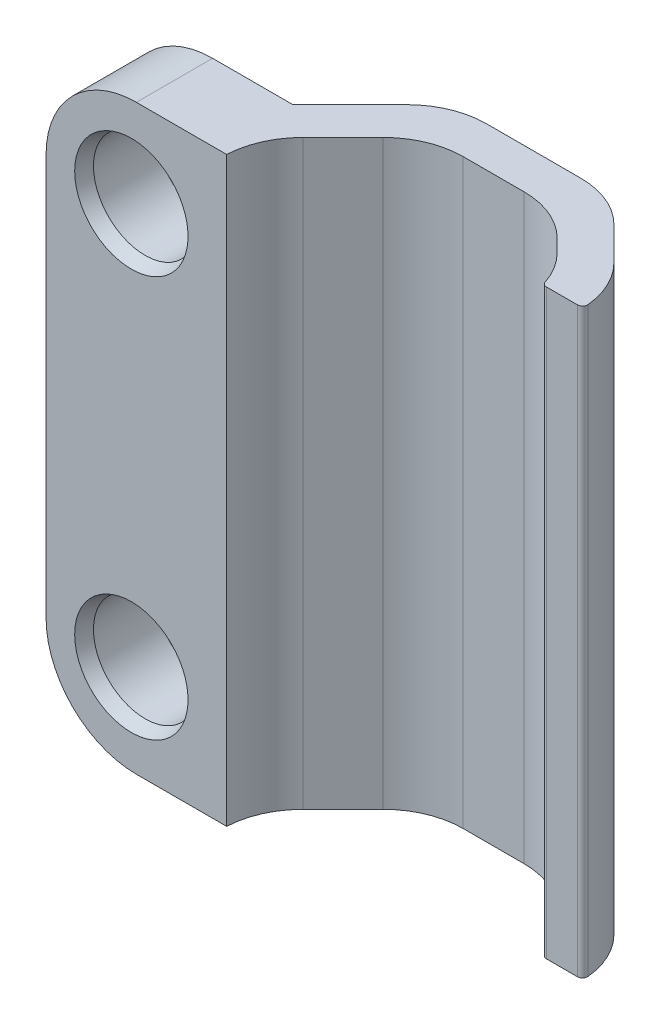
ISO-10303-21;
HEADER;
FILE_DESCRIPTION(('STEP AP214'),'2;1');
FILE_NAME('part.step','',(''),(''),'','','');
FILE_SCHEMA(('AUTOMOTIVE_DESIGN { 1 0 10303 214 1 1 1 1 }'));
ENDSEC;
DATA;
#1=APPLICATION_CONTEXT('core data for automotive mechanical design processes');
#2=APPLICATION_PROTOCOL_DEFINITION('international standard','automotive_design',2000,#1);
#3=PRODUCT_CONTEXT('',#1,'mechanical');
#4=PRODUCT('Part','Part','',(#3));
#5=PRODUCT_RELATED_PRODUCT_CATEGORY('part','',(#4));
#6=PRODUCT_DEFINITION_FORMATION('','',#4);
#7=PRODUCT_DEFINITION_CONTEXT('part definition',#1,'design');
#8=PRODUCT_DEFINITION('design','',#6,#7);
#9=PRODUCT_DEFINITION_SHAPE('','',#8);
#10=(LENGTH_UNIT() NAMED_UNIT(*) SI_UNIT(.MILLI.,.METRE.));
#11=(NAMED_UNIT(*) PLANE_ANGLE_UNIT() SI_UNIT($,.RADIAN.));
#12=(NAMED_UNIT(*) SI_UNIT($,.STERADIAN.) SOLID_ANGLE_UNIT());
#13=UNCERTAINTY_MEASURE_WITH_UNIT(LENGTH_MEASURE(1.E-05),#10,'distance_accuracy_value','');
#14=(GEOMETRIC_REPRESENTATION_CONTEXT(3) GLOBAL_UNCERTAINTY_ASSIGNED_CONTEXT((#13)) GLOBAL_UNIT_ASSIGNED_CONTEXT((#10,
#11,#12)) REPRESENTATION_CONTEXT('',''));
#15=CARTESIAN_POINT('',(0.,0.,0.));
#16=DIRECTION('',(0.,0.,1.));
#17=DIRECTION('',(1.,0.,0.));
#18=AXIS2_PLACEMENT_3D('',#15,#16,#17);
#19=CARTESIAN_POINT('',(0.,29.,0.));
#20=DIRECTION('',(0.,0.,-1.));
#21=DIRECTION('',(-1.,0.,0.));
#22=AXIS2_PLACEMENT_3D('',#19,#20,#21);
#23=PLANE('',#22);
#24=CARTESIAN_POINT('',(4.25,24.5,0.));
#25=DIRECTION('',(0.,0.,-1.));
#26=DIRECTION('',(-1.,0.,0.));
#27=AXIS2_PLACEMENT_3D('',#24,#25,#26);
#28=CIRCLE('',#27,2.82500000000005);
#29=CARTESIAN_POINT('',(1.42499999999995,24.5,0.));
#30=VERTEX_POINT('',#29);
#31=EDGE_CURVE('E258',#30,#30,#28,.T.);
#32=ORIENTED_EDGE('',*,*,#31,.T.);
#33=EDGE_LOOP('',(#32));
#34=FACE_BOUND('',#33,.T.);
#35=CARTESIAN_POINT('',(4.25,4.5,0.));
#36=DIRECTION('',(0.,0.,-1.));
#37=DIRECTION('',(-1.,0.,0.));
#38=AXIS2_PLACEMENT_3D('',#35,#36,#37);
#39=CIRCLE('',#38,2.82500000000005);
#40=CARTESIAN_POINT('',(1.42499999999995,4.5,0.));
#41=VERTEX_POINT('',#40);
#42=EDGE_CURVE('E255',#41,#41,#39,.T.);
#43=ORIENTED_EDGE('',*,*,#42,.T.);
#44=EDGE_LOOP('',(#43));
#45=FACE_BOUND('',#44,.T.);
#46=DIRECTION('',(0.,-1.,0.));
#47=VECTOR('',#46,1.);
#48=CARTESIAN_POINT('',(0.,29.,0.));
#49=LINE('',#48,#47);
#50=CARTESIAN_POINT('',(0.,24.5,0.));
#51=VERTEX_POINT('',#50);
#52=CARTESIAN_POINT('',(0.,4.50000000000001,0.));
#53=VERTEX_POINT('',#52);
#54=EDGE_CURVE('E396',#51,#53,#49,.T.);
#55=ORIENTED_EDGE('',*,*,#54,.T.);
#56=CARTESIAN_POINT('',(4.5,4.5,0.));
#57=DIRECTION('',(0.,0.,-1.));
#58=DIRECTION('',(-1.,0.,0.));
#59=AXIS2_PLACEMENT_3D('',#56,#57,#58);
#60=CIRCLE('',#59,4.5);
#61=CARTESIAN_POINT('',(4.5,0.,0.));
#62=VERTEX_POINT('',#61);
#63=EDGE_CURVE('E372',#53,#62,#60,.F.);
#64=ORIENTED_EDGE('',*,*,#63,.T.);
#65=DIRECTION('',(1.,0.,0.));
#66=VECTOR('',#65,1.);
#67=CARTESIAN_POINT('',(0.,0.,0.));
#68=LINE('',#67,#66);
#69=CARTESIAN_POINT('',(9.,0.,0.));
#70=VERTEX_POINT('',#69);
#71=EDGE_CURVE('E226',#62,#70,#68,.T.);
#72=ORIENTED_EDGE('',*,*,#71,.T.);
#73=DIRECTION('',(0.,-1.,0.));
#74=VECTOR('',#73,1.);
#75=CARTESIAN_POINT('',(9.,29.,0.));
#76=LINE('',#75,#74);
#77=CARTESIAN_POINT('',(9.,29.,0.));
#78=VERTEX_POINT('',#77);
#79=EDGE_CURVE('E223',#78,#70,#76,.T.);
#80=ORIENTED_EDGE('',*,*,#79,.F.);
#81=DIRECTION('',(1.,0.,0.));
#82=VECTOR('',#81,1.);
#83=CARTESIAN_POINT('',(0.,29.,0.));
#84=LINE('',#83,#82);
#85=CARTESIAN_POINT('',(4.5,29.,0.));
#86=VERTEX_POINT('',#85);
#87=EDGE_CURVE('E206',#86,#78,#84,.T.);
#88=ORIENTED_EDGE('',*,*,#87,.F.);
#89=CARTESIAN_POINT('',(4.5,24.5,0.));
#90=DIRECTION('',(0.,0.,-1.));
#91=DIRECTION('',(-1.,0.,0.));
#92=AXIS2_PLACEMENT_3D('',#89,#90,#91);
#93=CIRCLE('',#92,4.5);
#94=EDGE_CURVE('E374',#86,#51,#93,.F.);
#95=ORIENTED_EDGE('',*,*,#94,.T.);
#96=EDGE_LOOP('',(#55,#64,#72,#80,#88,#95));
#97=FACE_BOUND('',#96,.T.);
#98=ADVANCED_FACE('F39',(#34,#45,#97),#23,.F.);
#99=CARTESIAN_POINT('',(13.3284271247462,29.,-5.8));
#100=DIRECTION('',(-0.707106781186549,0.,-0.707106781186546));
#101=DIRECTION('',(-0.707106781186546,0.,0.707106781186549));
#102=AXIS2_PLACEMENT_3D('',#99,#100,#101);
#103=PLANE('',#102);
#104=DIRECTION('',(0.707106781186546,0.,-0.707106781186549));
#105=VECTOR('',#104,1.);
#106=CARTESIAN_POINT('',(13.3284271247462,29.,-5.8));
#107=LINE('',#106,#105);
#108=CARTESIAN_POINT('',(10.167067985237,29.,-2.63864086049085));
#109=VERTEX_POINT('',#108);
#110=CARTESIAN_POINT('',(12.1568542494924,29.,-4.62842712474618));
#111=VERTEX_POINT('',#110);
#112=EDGE_CURVE('E218',#109,#111,#107,.T.);
#113=ORIENTED_EDGE('',*,*,#112,.F.);
#114=DIRECTION('',(0.,-1.,0.));
#115=VECTOR('',#114,1.);
#116=CARTESIAN_POINT('',(10.167067985237,29.,-2.63864086049085));
#117=LINE('',#116,#115);
#118=CARTESIAN_POINT('',(10.167067985237,0.,-2.63864086049085));
#119=VERTEX_POINT('',#118);
#120=EDGE_CURVE('E235',#109,#119,#117,.T.);
#121=ORIENTED_EDGE('',*,*,#120,.T.);
#122=DIRECTION('',(0.707106781186546,0.,-0.707106781186549));
#123=VECTOR('',#122,1.);
#124=CARTESIAN_POINT('',(13.3284271247462,0.,-5.8));
#125=LINE('',#124,#123);
#126=CARTESIAN_POINT('',(12.1568542494924,0.,-4.62842712474618));
#127=VERTEX_POINT('',#126);
#128=EDGE_CURVE('E416',#119,#127,#125,.T.);
#129=ORIENTED_EDGE('',*,*,#128,.T.);
#130=DIRECTION('',(0.,-1.,0.));
#131=VECTOR('',#130,1.);
#132=CARTESIAN_POINT('',(12.1568542494924,29.,-4.62842712474618));
#133=LINE('',#132,#131);
#134=EDGE_CURVE('E331',#127,#111,#133,.F.);
#135=ORIENTED_EDGE('',*,*,#134,.T.);
#136=EDGE_LOOP('',(#113,#121,#129,#135));
#137=FACE_BOUND('',#136,.T.);
#138=ADVANCED_FACE('F465',(#137),#103,.F.);
#139=CARTESIAN_POINT('',(19.6715728752538,29.,-5.8));
#140=DIRECTION('',(0.,0.,-1.));
#141=DIRECTION('',(-1.,0.,0.));
#142=AXIS2_PLACEMENT_3D('',#139,#140,#141);
#143=PLANE('',#142);
#144=DIRECTION('',(1.,0.,0.));
#145=VECTOR('',#144,1.);
#146=CARTESIAN_POINT('',(19.6715728752538,0.,-5.8));
#147=LINE('',#146,#145);
#148=CARTESIAN_POINT('',(14.9852813742386,0.,-5.8));
#149=VERTEX_POINT('',#148);
#150=CARTESIAN_POINT('',(18.0147186257614,0.,-5.8));
#151=VERTEX_POINT('',#150);
#152=EDGE_CURVE('E413',#149,#151,#147,.T.);
#153=ORIENTED_EDGE('',*,*,#152,.T.);
#154=DIRECTION('',(0.,-1.,0.));
#155=VECTOR('',#154,1.);
#156=CARTESIAN_POINT('',(18.0147186257614,29.,-5.8));
#157=LINE('',#156,#155);
#158=CARTESIAN_POINT('',(18.0147186257614,29.,-5.8));
#159=VERTEX_POINT('',#158);
#160=EDGE_CURVE('E323',#151,#159,#157,.F.);
#161=ORIENTED_EDGE('',*,*,#160,.T.);
#162=DIRECTION('',(1.,0.,0.));
#163=VECTOR('',#162,1.);
#164=CARTESIAN_POINT('',(19.6715728752538,29.,-5.8));
#165=LINE('',#164,#163);
#166=CARTESIAN_POINT('',(14.9852813742386,29.,-5.8));
#167=VERTEX_POINT('',#166);
#168=EDGE_CURVE('E433',#167,#159,#165,.T.);
#169=ORIENTED_EDGE('',*,*,#168,.F.);
#170=DIRECTION('',(0.,-1.,0.));
#171=VECTOR('',#170,1.);
#172=CARTESIAN_POINT('',(14.9852813742386,0.,-5.8));
#173=LINE('',#172,#171);
#174=EDGE_CURVE('E326',#167,#149,#173,.T.);
#175=ORIENTED_EDGE('',*,*,#174,.T.);
#176=EDGE_LOOP('',(#153,#161,#169,#175));
#177=FACE_BOUND('',#176,.T.);
#178=ADVANCED_FACE('F447',(#177),#143,.F.);
#179=CARTESIAN_POINT('',(22.5,29.,-2.97157287525381));
#180=DIRECTION('',(0.707106781186549,0.,-0.707106781186546));
#181=DIRECTION('',(-0.707106781186546,0.,-0.707106781186549));
#182=AXIS2_PLACEMENT_3D('',#179,#180,#181);
#183=PLANE('',#182);
#184=DIRECTION('',(0.707106781186546,0.,0.707106781186549));
#185=VECTOR('',#184,1.);
#186=CARTESIAN_POINT('',(22.5,0.,-2.97157287525381));
#187=LINE('',#186,#185);
#188=CARTESIAN_POINT('',(20.8431457505076,0.,-4.62842712474618));
#189=VERTEX_POINT('',#188);
#190=CARTESIAN_POINT('',(21.4784878304969,0.,-3.99308504475687));
#191=VERTEX_POINT('',#190);
#192=EDGE_CURVE('E411',#189,#191,#187,.T.);
#193=ORIENTED_EDGE('',*,*,#192,.T.);
#194=DIRECTION('',(0.,1.,0.));
#195=VECTOR('',#194,1.);
#196=CARTESIAN_POINT('',(21.4784878304969,29.,-3.99308504475687));
#197=LINE('',#196,#195);
#198=CARTESIAN_POINT('',(21.4784878304969,29.,-3.99308504475687));
#199=VERTEX_POINT('',#198);
#200=EDGE_CURVE('E309',#191,#199,#197,.T.);
#201=ORIENTED_EDGE('',*,*,#200,.T.);
#202=DIRECTION('',(0.707106781186546,0.,0.707106781186549));
#203=VECTOR('',#202,1.);
#204=CARTESIAN_POINT('',(22.5,29.,-2.97157287525381));
#205=LINE('',#204,#203);
#206=CARTESIAN_POINT('',(20.8431457505076,29.,-4.62842712474618));
#207=VERTEX_POINT('',#206);
#208=EDGE_CURVE('E298',#207,#199,#205,.T.);
#209=ORIENTED_EDGE('',*,*,#208,.F.);
#210=DIRECTION('',(0.,-1.,0.));
#211=VECTOR('',#210,1.);
#212=CARTESIAN_POINT('',(20.8431457505076,0.,-4.62842712474618));
#213=LINE('',#212,#211);
#214=EDGE_CURVE('E336',#207,#189,#213,.T.);
#215=ORIENTED_EDGE('',*,*,#214,.T.);
#216=EDGE_LOOP('',(#193,#201,#209,#215));
#217=FACE_BOUND('',#216,.T.);
#218=ADVANCED_FACE('F456',(#217),#183,.F.);
#219=CARTESIAN_POINT('',(22.5,29.,-2.25));
#220=DIRECTION('',(0.,0.,-1.));
#221=DIRECTION('',(-1.,0.,0.));
#222=AXIS2_PLACEMENT_3D('',#219,#220,#221);
#223=PLANE('',#222);
#224=DIRECTION('',(1.,0.,0.));
#225=VECTOR('',#224,1.);
#226=CARTESIAN_POINT('',(22.5,29.,-2.25));
#227=LINE('',#226,#225);
#228=CARTESIAN_POINT('',(22.6848297858109,29.,-2.25));
#229=VERTEX_POINT('',#228);
#230=CARTESIAN_POINT('',(24.2343084879791,29.,-2.25));
#231=VERTEX_POINT('',#230);
#232=EDGE_CURVE('E288',#229,#231,#227,.T.);
#233=ORIENTED_EDGE('',*,*,#232,.F.);
#234=DIRECTION('',(0.,1.,0.));
#235=VECTOR('',#234,1.);
#236=CARTESIAN_POINT('',(22.6848297858109,29.,-2.25));
#237=LINE('',#236,#235);
#238=CARTESIAN_POINT('',(22.6848297858109,0.,-2.25));
#239=VERTEX_POINT('',#238);
#240=EDGE_CURVE('E272',#229,#239,#237,.F.);
#241=ORIENTED_EDGE('',*,*,#240,.T.);
#242=DIRECTION('',(1.,0.,0.));
#243=VECTOR('',#242,1.);
#244=CARTESIAN_POINT('',(22.5,0.,-2.25));
#245=LINE('',#244,#243);
#246=CARTESIAN_POINT('',(24.2343084879791,0.,-2.25));
#247=VERTEX_POINT('',#246);
#248=EDGE_CURVE('E306',#239,#247,#245,.T.);
#249=ORIENTED_EDGE('',*,*,#248,.T.);
#250=DIRECTION('',(0.,1.,0.));
#251=VECTOR('',#250,1.);
#252=CARTESIAN_POINT('',(24.2343084879791,29.,-2.25));
#253=LINE('',#252,#251);
#254=EDGE_CURVE('E269',#247,#231,#253,.T.);
#255=ORIENTED_EDGE('',*,*,#254,.T.);
#256=EDGE_LOOP('',(#233,#241,#249,#255));
#257=FACE_BOUND('',#256,.T.);
#258=ADVANCED_FACE('F293',(#257),#223,.F.);
#259=CARTESIAN_POINT('',(20.5,29.,-7.8));
#260=DIRECTION('',(-0.70710678118655,0.,0.707106781186545));
#261=DIRECTION('',(0.707106781186545,0.,0.70710678118655));
#262=AXIS2_PLACEMENT_3D('',#259,#260,#261);
#263=PLANE('',#262);
#264=DIRECTION('',(-0.707106781186545,0.,-0.70710678118655));
#265=VECTOR('',#264,1.);
#266=CARTESIAN_POINT('',(20.5,29.,-7.8));
#267=LINE('',#266,#265);
#268=CARTESIAN_POINT('',(23.3298940791421,29.,-4.97010592085792));
#269=VERTEX_POINT('',#268);
#270=CARTESIAN_POINT('',(21.6715728752538,29.,-6.62842712474618));
#271=VERTEX_POINT('',#270);
#272=EDGE_CURVE('E297',#269,#271,#267,.T.);
#273=ORIENTED_EDGE('',*,*,#272,.F.);
#274=DIRECTION('',(0.,-1.,0.));
#275=VECTOR('',#274,1.);
#276=CARTESIAN_POINT('',(23.3298940791421,29.,-4.97010592085792));
#277=LINE('',#276,#275);
#278=CARTESIAN_POINT('',(23.3298940791421,0.,-4.97010592085792));
#279=VERTEX_POINT('',#278);
#280=EDGE_CURVE('E356',#269,#279,#277,.T.);
#281=ORIENTED_EDGE('',*,*,#280,.T.);
#282=DIRECTION('',(-0.707106781186545,0.,-0.70710678118655));
#283=VECTOR('',#282,1.);
#284=CARTESIAN_POINT('',(20.5,0.,-7.8));
#285=LINE('',#284,#283);
#286=CARTESIAN_POINT('',(21.6715728752538,0.,-6.62842712474618));
#287=VERTEX_POINT('',#286);
#288=EDGE_CURVE('E407',#279,#287,#285,.T.);
#289=ORIENTED_EDGE('',*,*,#288,.T.);
#290=DIRECTION('',(0.,-1.,0.));
#291=VECTOR('',#290,1.);
#292=CARTESIAN_POINT('',(21.6715728752538,29.,-6.62842712474618));
#293=LINE('',#292,#291);
#294=EDGE_CURVE('E360',#287,#271,#293,.F.);
#295=ORIENTED_EDGE('',*,*,#294,.T.);
#296=EDGE_LOOP('',(#273,#281,#289,#295));
#297=FACE_BOUND('',#296,.T.);
#298=ADVANCED_FACE('F463',(#297),#263,.F.);
#299=CARTESIAN_POINT('',(12.5,29.,-7.8));
#300=DIRECTION('',(0.,0.,1.));
#301=DIRECTION('',(1.,0.,0.));
#302=AXIS2_PLACEMENT_3D('',#299,#300,#301);
#303=PLANE('',#302);
#304=DIRECTION('',(-1.,0.,0.));
#305=VECTOR('',#304,1.);
#306=CARTESIAN_POINT('',(12.5,29.,-7.8));
#307=LINE('',#306,#305);
#308=CARTESIAN_POINT('',(18.8431457505076,29.,-7.8));
#309=VERTEX_POINT('',#308);
#310=CARTESIAN_POINT('',(14.1568542494924,29.,-7.8));
#311=VERTEX_POINT('',#310);
#312=EDGE_CURVE('E425',#309,#311,#307,.T.);
#313=ORIENTED_EDGE('',*,*,#312,.F.);
#314=DIRECTION('',(0.,-1.,0.));
#315=VECTOR('',#314,1.);
#316=CARTESIAN_POINT('',(18.8431457505076,29.,-7.8));
#317=LINE('',#316,#315);
#318=CARTESIAN_POINT('',(18.8431457505076,0.,-7.8));
#319=VERTEX_POINT('',#318);
#320=EDGE_CURVE('E314',#309,#319,#317,.T.);
#321=ORIENTED_EDGE('',*,*,#320,.T.);
#322=DIRECTION('',(-1.,0.,0.));
#323=VECTOR('',#322,1.);
#324=CARTESIAN_POINT('',(12.5,0.,-7.8));
#325=LINE('',#324,#323);
#326=CARTESIAN_POINT('',(14.1568542494924,0.,-7.8));
#327=VERTEX_POINT('',#326);
#328=EDGE_CURVE('E404',#319,#327,#325,.T.);
#329=ORIENTED_EDGE('',*,*,#328,.T.);
#330=DIRECTION('',(0.,-1.,0.));
#331=VECTOR('',#330,1.);
#332=CARTESIAN_POINT('',(14.1568542494924,29.,-7.8));
#333=LINE('',#332,#331);
#334=EDGE_CURVE('E320',#327,#311,#333,.F.);
#335=ORIENTED_EDGE('',*,*,#334,.T.);
#336=EDGE_LOOP('',(#313,#321,#329,#335));
#337=FACE_BOUND('',#336,.T.);
#338=ADVANCED_FACE('F531',(#337),#303,.F.);
#339=CARTESIAN_POINT('',(8.5,29.,-3.8));
#340=DIRECTION('',(0.707106781186549,0.,0.707106781186546));
#341=DIRECTION('',(0.707106781186546,0.,-0.707106781186549));
#342=AXIS2_PLACEMENT_3D('',#339,#340,#341);
#343=PLANE('',#342);
#344=DIRECTION('',(-0.707106781186546,0.,0.707106781186549));
#345=VECTOR('',#344,1.);
#346=CARTESIAN_POINT('',(8.5,29.,-3.8));
#347=LINE('',#346,#345);
#348=CARTESIAN_POINT('',(11.3284271247462,29.,-6.62842712474618));
#349=VERTEX_POINT('',#348);
#350=CARTESIAN_POINT('',(8.5,29.,-3.8));
#351=VERTEX_POINT('',#350);
#352=EDGE_CURVE('E422',#349,#351,#347,.T.);
#353=ORIENTED_EDGE('',*,*,#352,.F.);
#354=DIRECTION('',(0.,-1.,0.));
#355=VECTOR('',#354,1.);
#356=CARTESIAN_POINT('',(11.3284271247462,29.,-6.62842712474619));
#357=LINE('',#356,#355);
#358=CARTESIAN_POINT('',(11.3284271247462,0.,-6.62842712474618));
#359=VERTEX_POINT('',#358);
#360=EDGE_CURVE('E310',#349,#359,#357,.T.);
#361=ORIENTED_EDGE('',*,*,#360,.T.);
#362=DIRECTION('',(-0.707106781186546,0.,0.707106781186549));
#363=VECTOR('',#362,1.);
#364=CARTESIAN_POINT('',(8.5,0.,-3.8));
#365=LINE('',#364,#363);
#366=CARTESIAN_POINT('',(8.5,0.,-3.8));
#367=VERTEX_POINT('',#366);
#368=EDGE_CURVE('E402',#359,#367,#365,.T.);
#369=ORIENTED_EDGE('',*,*,#368,.T.);
#370=DIRECTION('',(0.,-1.,0.));
#371=VECTOR('',#370,1.);
#372=CARTESIAN_POINT('',(8.5,29.,-3.8));
#373=LINE('',#372,#371);
#374=EDGE_CURVE('E230',#351,#367,#373,.T.);
#375=ORIENTED_EDGE('',*,*,#374,.F.);
#376=EDGE_LOOP('',(#353,#361,#369,#375));
#377=FACE_BOUND('',#376,.T.);
#378=ADVANCED_FACE('F537',(#377),#343,.F.);
#379=CARTESIAN_POINT('',(0.,29.,-3.8));
#380=DIRECTION('',(0.,0.,1.));
#381=DIRECTION('',(1.,0.,0.));
#382=AXIS2_PLACEMENT_3D('',#379,#380,#381);
#383=PLANE('',#382);
#384=CARTESIAN_POINT('',(4.25,4.5,-3.8));
#385=DIRECTION('',(0.,0.,1.));
#386=DIRECTION('',(1.,0.,0.));
#387=AXIS2_PLACEMENT_3D('',#384,#385,#386);
#388=CIRCLE('',#387,2.575);
#389=CARTESIAN_POINT('',(1.675,4.5,-3.8));
#390=VERTEX_POINT('',#389);
#391=EDGE_CURVE('E382',#390,#390,#388,.T.);
#392=ORIENTED_EDGE('',*,*,#391,.T.);
#393=EDGE_LOOP('',(#392));
#394=FACE_BOUND('',#393,.T.);
#395=CARTESIAN_POINT('',(4.25,24.5,-3.8));
#396=DIRECTION('',(0.,0.,1.));
#397=DIRECTION('',(1.,0.,0.));
#398=AXIS2_PLACEMENT_3D('',#395,#396,#397);
#399=CIRCLE('',#398,2.575);
#400=CARTESIAN_POINT('',(1.675,24.5,-3.8));
#401=VERTEX_POINT('',#400);
#402=EDGE_CURVE('E385',#401,#401,#399,.T.);
#403=ORIENTED_EDGE('',*,*,#402,.T.);
#404=EDGE_LOOP('',(#403));
#405=FACE_BOUND('',#404,.T.);
#406=DIRECTION('',(-1.,0.,0.));
#407=VECTOR('',#406,1.);
#408=CARTESIAN_POINT('',(0.,0.,-3.8));
#409=LINE('',#408,#407);
#410=CARTESIAN_POINT('',(4.5,0.,-3.8));
#411=VERTEX_POINT('',#410);
#412=EDGE_CURVE('E219',#367,#411,#409,.T.);
#413=ORIENTED_EDGE('',*,*,#412,.T.);
#414=CARTESIAN_POINT('',(4.5,4.5,-3.8));
#415=DIRECTION('',(0.,0.,1.));
#416=DIRECTION('',(1.,0.,0.));
#417=AXIS2_PLACEMENT_3D('',#414,#415,#416);
#418=CIRCLE('',#417,4.5);
#419=CARTESIAN_POINT('',(0.,4.50000000000001,-3.8));
#420=VERTEX_POINT('',#419);
#421=EDGE_CURVE('E365',#411,#420,#418,.F.);
#422=ORIENTED_EDGE('',*,*,#421,.T.);
#423=DIRECTION('',(0.,-1.,0.));
#424=VECTOR('',#423,1.);
#425=CARTESIAN_POINT('',(0.,29.,-3.8));
#426=LINE('',#425,#424);
#427=CARTESIAN_POINT('',(0.,24.5,-3.8));
#428=VERTEX_POINT('',#427);
#429=EDGE_CURVE('E392',#428,#420,#426,.T.);
#430=ORIENTED_EDGE('',*,*,#429,.F.);
#431=CARTESIAN_POINT('',(4.5,24.5,-3.8));
#432=DIRECTION('',(0.,0.,1.));
#433=DIRECTION('',(1.,0.,0.));
#434=AXIS2_PLACEMENT_3D('',#431,#432,#433);
#435=CIRCLE('',#434,4.5);
#436=CARTESIAN_POINT('',(4.5,29.,-3.8));
#437=VERTEX_POINT('',#436);
#438=EDGE_CURVE('E367',#428,#437,#435,.F.);
#439=ORIENTED_EDGE('',*,*,#438,.T.);
#440=DIRECTION('',(-1.,0.,0.));
#441=VECTOR('',#440,1.);
#442=CARTESIAN_POINT('',(0.,29.,-3.8));
#443=LINE('',#442,#441);
#444=EDGE_CURVE('E399',#351,#437,#443,.T.);
#445=ORIENTED_EDGE('',*,*,#444,.F.);
#446=ORIENTED_EDGE('',*,*,#374,.T.);
#447=EDGE_LOOP('',(#413,#422,#430,#439,#445,#446));
#448=FACE_BOUND('',#447,.T.);
#449=ADVANCED_FACE('F542',(#394,#405,#448),#383,.F.);
#450=CARTESIAN_POINT('',(0.,29.,0.));
#451=DIRECTION('',(1.,0.,0.));
#452=DIRECTION('',(0.,0.,-1.));
#453=AXIS2_PLACEMENT_3D('',#450,#451,#452);
#454=PLANE('',#453);
#455=ORIENTED_EDGE('',*,*,#429,.T.);
#456=DIRECTION('',(0.,0.,1.));
#457=VECTOR('',#456,1.);
#458=CARTESIAN_POINT('',(0.,4.5,0.));
#459=LINE('',#458,#457);
#460=EDGE_CURVE('E377',#420,#53,#459,.T.);
#461=ORIENTED_EDGE('',*,*,#460,.T.);
#462=ORIENTED_EDGE('',*,*,#54,.F.);
#463=DIRECTION('',(0.,0.,1.));
#464=VECTOR('',#463,1.);
#465=CARTESIAN_POINT('',(0.,24.5,-3.8));
#466=LINE('',#465,#464);
#467=EDGE_CURVE('E229',#51,#428,#466,.F.);
#468=ORIENTED_EDGE('',*,*,#467,.T.);
#469=EDGE_LOOP('',(#455,#461,#462,#468));
#470=FACE_BOUND('',#469,.T.);
#471=ADVANCED_FACE('F548',(#470),#454,.F.);
#472=CARTESIAN_POINT('',(0.,29.,0.));
#473=DIRECTION('',(0.,1.,0.));
#474=DIRECTION('',(0.,0.,1.));
#475=AXIS2_PLACEMENT_3D('',#472,#473,#474);
#476=PLANE('',#475);
#477=CARTESIAN_POINT('',(18.6500607057507,29.,-1.16465792001069));
#478=DIRECTION('',(0.,1.,0.));
#479=DIRECTION('',(0.,0.,1.));
#480=AXIS2_PLACEMENT_3D('',#477,#478,#479);
#481=CIRCLE('',#480,4.);
#482=CARTESIAN_POINT('',(22.4474904281603,29.,-2.42145046588298));
#483=VERTEX_POINT('',#482);
#484=EDGE_CURVE('E244',#199,#483,#481,.F.);
#485=ORIENTED_EDGE('',*,*,#484,.T.);
#486=CARTESIAN_POINT('',(22.6848297858109,29.,-2.5));
#487=DIRECTION('',(0.,1.,0.));
#488=DIRECTION('',(0.,0.,1.));
#489=AXIS2_PLACEMENT_3D('',#486,#487,#488);
#490=CIRCLE('',#489,0.25);
#491=EDGE_CURVE('E48',#483,#229,#490,.T.);
#492=ORIENTED_EDGE('',*,*,#491,.T.);
#493=ORIENTED_EDGE('',*,*,#232,.T.);
#494=CARTESIAN_POINT('',(24.2343084879791,29.,-2.5));
#495=DIRECTION('',(0.,1.,0.));
#496=DIRECTION('',(0.,0.,1.));
#497=AXIS2_PLACEMENT_3D('',#494,#495,#496);
#498=CIRCLE('',#497,0.25);
#499=CARTESIAN_POINT('',(24.483164590218,29.,-2.52388808025922));
#500=VERTEX_POINT('',#499);
#501=EDGE_CURVE('E58',#231,#500,#498,.T.);
#502=ORIENTED_EDGE('',*,*,#501,.T.);
#503=CARTESIAN_POINT('',(20.5014669543959,29.,-2.14167879611174));
#504=DIRECTION('',(0.,1.,0.));
#505=DIRECTION('',(0.,0.,1.));
#506=AXIS2_PLACEMENT_3D('',#503,#504,#505);
#507=CIRCLE('',#506,4.);
#508=EDGE_CURVE('E340',#500,#269,#507,.T.);
#509=ORIENTED_EDGE('',*,*,#508,.T.);
#510=ORIENTED_EDGE('',*,*,#272,.T.);
#511=CARTESIAN_POINT('',(18.8431457505076,29.,-3.8));
#512=DIRECTION('',(0.,1.,0.));
#513=DIRECTION('',(0.,0.,1.));
#514=AXIS2_PLACEMENT_3D('',#511,#512,#513);
#515=CIRCLE('',#514,4.);
#516=EDGE_CURVE('E343',#271,#309,#515,.T.);
#517=ORIENTED_EDGE('',*,*,#516,.T.);
#518=ORIENTED_EDGE('',*,*,#312,.T.);
#519=CARTESIAN_POINT('',(14.1568542494924,29.,-3.8));
#520=DIRECTION('',(0.,1.,0.));
#521=DIRECTION('',(0.,0.,1.));
#522=AXIS2_PLACEMENT_3D('',#519,#520,#521);
#523=CIRCLE('',#522,4.);
#524=EDGE_CURVE('E346',#311,#349,#523,.T.);
#525=ORIENTED_EDGE('',*,*,#524,.T.);
#526=ORIENTED_EDGE('',*,*,#352,.T.);
#527=ORIENTED_EDGE('',*,*,#444,.T.);
#528=DIRECTION('',(0.,0.,1.));
#529=VECTOR('',#528,1.);
#530=CARTESIAN_POINT('',(4.5,29.,0.));
#531=LINE('',#530,#529);
#532=EDGE_CURVE('E215',#437,#86,#531,.T.);
#533=ORIENTED_EDGE('',*,*,#532,.T.);
#534=ORIENTED_EDGE('',*,*,#87,.T.);
#535=CARTESIAN_POINT('',(12.9954951099832,29.,0.189786264255329));
#536=DIRECTION('',(0.,1.,0.));
#537=DIRECTION('',(0.,0.,1.));
#538=AXIS2_PLACEMENT_3D('',#535,#536,#537);
#539=CIRCLE('',#538,4.);
#540=EDGE_CURVE('E211',#78,#109,#539,.F.);
#541=ORIENTED_EDGE('',*,*,#540,.T.);
#542=ORIENTED_EDGE('',*,*,#112,.T.);
#543=CARTESIAN_POINT('',(14.9852813742386,29.,-1.8));
#544=DIRECTION('',(0.,1.,0.));
#545=DIRECTION('',(0.,0.,1.));
#546=AXIS2_PLACEMENT_3D('',#543,#544,#545);
#547=CIRCLE('',#546,4.);
#548=EDGE_CURVE('E252',#111,#167,#547,.F.);
#549=ORIENTED_EDGE('',*,*,#548,.T.);
#550=ORIENTED_EDGE('',*,*,#168,.T.);
#551=CARTESIAN_POINT('',(18.0147186257614,29.,-1.8));
#552=DIRECTION('',(0.,1.,0.));
#553=DIRECTION('',(0.,0.,1.));
#554=AXIS2_PLACEMENT_3D('',#551,#552,#553);
#555=CIRCLE('',#554,4.);
#556=EDGE_CURVE('E242',#159,#207,#555,.F.);
#557=ORIENTED_EDGE('',*,*,#556,.T.);
#558=ORIENTED_EDGE('',*,*,#208,.T.);
#559=EDGE_LOOP('',(#485,#492,#493,#502,#509,#510,#517,#518,#525,#526,#527,#533,#534,#541,#542,
#549,#550,#557,#558));
#560=FACE_BOUND('',#559,.T.);
#561=ADVANCED_FACE('F208',(#560),#476,.T.);
#562=CARTESIAN_POINT('',(0.,0.,0.));
#563=DIRECTION('',(0.,1.,0.));
#564=DIRECTION('',(0.,0.,1.));
#565=AXIS2_PLACEMENT_3D('',#562,#563,#564);
#566=PLANE('',#565);
#567=ORIENTED_EDGE('',*,*,#248,.F.);
#568=CARTESIAN_POINT('',(22.6848297858109,0.,-2.5));
#569=DIRECTION('',(0.,1.,0.));
#570=DIRECTION('',(0.,0.,1.));
#571=AXIS2_PLACEMENT_3D('',#568,#569,#570);
#572=CIRCLE('',#571,0.25);
#573=CARTESIAN_POINT('',(22.4474904281603,0.,-2.42145046588298));
#574=VERTEX_POINT('',#573);
#575=EDGE_CURVE('E278',#239,#574,#572,.F.);
#576=ORIENTED_EDGE('',*,*,#575,.T.);
#577=CARTESIAN_POINT('',(18.6500607057507,0.,-1.16465792001069));
#578=DIRECTION('',(0.,1.,0.));
#579=DIRECTION('',(0.,0.,1.));
#580=AXIS2_PLACEMENT_3D('',#577,#578,#579);
#581=CIRCLE('',#580,4.);
#582=EDGE_CURVE('E304',#574,#191,#581,.T.);
#583=ORIENTED_EDGE('',*,*,#582,.T.);
#584=ORIENTED_EDGE('',*,*,#192,.F.);
#585=CARTESIAN_POINT('',(18.0147186257614,0.,-1.8));
#586=DIRECTION('',(0.,1.,0.));
#587=DIRECTION('',(0.,0.,1.));
#588=AXIS2_PLACEMENT_3D('',#585,#586,#587);
#589=CIRCLE('',#588,4.);
#590=EDGE_CURVE('E237',#189,#151,#589,.T.);
#591=ORIENTED_EDGE('',*,*,#590,.T.);
#592=ORIENTED_EDGE('',*,*,#152,.F.);
#593=CARTESIAN_POINT('',(14.9852813742386,0.,-1.8));
#594=DIRECTION('',(0.,1.,0.));
#595=DIRECTION('',(0.,0.,1.));
#596=AXIS2_PLACEMENT_3D('',#593,#594,#595);
#597=CIRCLE('',#596,4.);
#598=EDGE_CURVE('E250',#149,#127,#597,.T.);
#599=ORIENTED_EDGE('',*,*,#598,.T.);
#600=ORIENTED_EDGE('',*,*,#128,.F.);
#601=CARTESIAN_POINT('',(12.9954951099832,0.,0.189786264255329));
#602=DIRECTION('',(0.,1.,0.));
#603=DIRECTION('',(0.,0.,1.));
#604=AXIS2_PLACEMENT_3D('',#601,#602,#603);
#605=CIRCLE('',#604,4.);
#606=EDGE_CURVE('E238',#119,#70,#605,.T.);
#607=ORIENTED_EDGE('',*,*,#606,.T.);
#608=ORIENTED_EDGE('',*,*,#71,.F.);
#609=DIRECTION('',(0.,0.,1.));
#610=VECTOR('',#609,1.);
#611=CARTESIAN_POINT('',(4.5,0.,0.));
#612=LINE('',#611,#610);
#613=EDGE_CURVE('E370',#62,#411,#612,.F.);
#614=ORIENTED_EDGE('',*,*,#613,.T.);
#615=ORIENTED_EDGE('',*,*,#412,.F.);
#616=ORIENTED_EDGE('',*,*,#368,.F.);
#617=CARTESIAN_POINT('',(14.1568542494924,0.,-3.8));
#618=DIRECTION('',(0.,1.,0.));
#619=DIRECTION('',(0.,0.,1.));
#620=AXIS2_PLACEMENT_3D('',#617,#618,#619);
#621=CIRCLE('',#620,4.);
#622=EDGE_CURVE('E354',#359,#327,#621,.F.);
#623=ORIENTED_EDGE('',*,*,#622,.T.);
#624=ORIENTED_EDGE('',*,*,#328,.F.);
#625=CARTESIAN_POINT('',(18.8431457505076,0.,-3.8));
#626=DIRECTION('',(0.,1.,0.));
#627=DIRECTION('',(0.,0.,1.));
#628=AXIS2_PLACEMENT_3D('',#625,#626,#627);
#629=CIRCLE('',#628,4.);
#630=EDGE_CURVE('E352',#319,#287,#629,.F.);
#631=ORIENTED_EDGE('',*,*,#630,.T.);
#632=ORIENTED_EDGE('',*,*,#288,.F.);
#633=CARTESIAN_POINT('',(20.5014669543959,0.,-2.14167879611174));
#634=DIRECTION('',(0.,1.,0.));
#635=DIRECTION('',(0.,0.,1.));
#636=AXIS2_PLACEMENT_3D('',#633,#634,#635);
#637=CIRCLE('',#636,4.);
#638=CARTESIAN_POINT('',(24.483164590218,0.,-2.52388808025922));
#639=VERTEX_POINT('',#638);
#640=EDGE_CURVE('E349',#279,#639,#637,.F.);
#641=ORIENTED_EDGE('',*,*,#640,.T.);
#642=CARTESIAN_POINT('',(24.2343084879791,0.,-2.5));
#643=DIRECTION('',(0.,1.,0.));
#644=DIRECTION('',(0.,0.,1.));
#645=AXIS2_PLACEMENT_3D('',#642,#643,#644);
#646=CIRCLE('',#645,0.25);
#647=EDGE_CURVE('E276',#639,#247,#646,.F.);
#648=ORIENTED_EDGE('',*,*,#647,.T.);
#649=EDGE_LOOP('',(#567,#576,#583,#584,#591,#592,#599,#600,#607,#608,#614,#615,#616,#623,#624,
#631,#632,#641,#648));
#650=FACE_BOUND('',#649,.T.);
#651=ADVANCED_FACE('F302',(#650),#566,.F.);
#652=CARTESIAN_POINT('',(4.25,24.5,0.));
#653=DIRECTION('',(0.,0.,-1.));
#654=DIRECTION('',(-1.,0.,0.));
#655=AXIS2_PLACEMENT_3D('',#652,#653,#654);
#656=CYLINDRICAL_SURFACE('',#655,2.575);
#657=CARTESIAN_POINT('',(4.25,24.5,-0.68686935486379));
#658=DIRECTION('',(0.,0.,-1.));
#659=DIRECTION('',(-1.,0.,0.));
#660=AXIS2_PLACEMENT_3D('',#657,#658,#659);
#661=CIRCLE('',#660,2.575);
#662=CARTESIAN_POINT('',(1.675,24.5,-0.68686935486379));
#663=VERTEX_POINT('',#662);
#664=EDGE_CURVE('E262',#663,#663,#661,.F.);
#665=CARTESIAN_POINT('',(1.675,24.5,-0.68686935486379));
#666=CARTESIAN_POINT('',(1.675,24.5,-0.719297799083959));
#667=CARTESIAN_POINT('',(1.675,24.5,-0.751726243304128));
#668=CARTESIAN_POINT('',(1.675,24.5,-0.816583131744466));
#669=CARTESIAN_POINT('',(1.675,24.5,-0.849011575964635));
#670=CARTESIAN_POINT('',(1.675,24.5,-0.913868464404972));
#671=CARTESIAN_POINT('',(1.675,24.5,-0.946296908625141));
#672=CARTESIAN_POINT('',(1.675,24.5,-1.01115379706548));
#673=CARTESIAN_POINT('',(1.675,24.5,-1.04358224128565));
#674=CARTESIAN_POINT('',(1.675,24.5,-1.10843912972599));
#675=CARTESIAN_POINT('',(1.675,24.5,-1.14086757394615));
#676=CARTESIAN_POINT('',(1.675,24.5,-1.20572446238649));
#677=CARTESIAN_POINT('',(1.675,24.5,-1.23815290660666));
#678=CARTESIAN_POINT('',(1.675,24.5,-1.303009795047));
#679=CARTESIAN_POINT('',(1.675,24.5,-1.33543823926717));
#680=CARTESIAN_POINT('',(1.675,24.5,-1.4002951277075));
#681=CARTESIAN_POINT('',(1.675,24.5,-1.43272357192767));
#682=CARTESIAN_POINT('',(1.675,24.5,-1.49758046036801));
#683=CARTESIAN_POINT('',(1.675,24.5,-1.53000890458818));
#684=CARTESIAN_POINT('',(1.675,24.5,-1.59486579302852));
#685=CARTESIAN_POINT('',(1.675,24.5,-1.62729423724869));
#686=CARTESIAN_POINT('',(1.675,24.5,-1.69215112568902));
#687=CARTESIAN_POINT('',(1.675,24.5,-1.72457956990919));
#688=CARTESIAN_POINT('',(1.675,24.5,-1.78943645834953));
#689=CARTESIAN_POINT('',(1.675,24.5,-1.8218649025697));
#690=CARTESIAN_POINT('',(1.675,24.5,-1.88672179101004));
#691=CARTESIAN_POINT('',(1.675,24.5,-1.91915023523021));
#692=CARTESIAN_POINT('',(1.675,24.5,-1.98400712367054));
#693=CARTESIAN_POINT('',(1.675,24.5,-2.01643556789071));
#694=CARTESIAN_POINT('',(1.675,24.5,-2.08129245633105));
#695=CARTESIAN_POINT('',(1.675,24.5,-2.11372090055122));
#696=CARTESIAN_POINT('',(1.675,24.5,-2.17857778899156));
#697=CARTESIAN_POINT('',(1.675,24.5,-2.21100623321173));
#698=CARTESIAN_POINT('',(1.675,24.5,-2.27586312165206));
#699=CARTESIAN_POINT('',(1.675,24.5,-2.30829156587223));
#700=CARTESIAN_POINT('',(1.675,24.5,-2.37314845431257));
#701=CARTESIAN_POINT('',(1.675,24.5,-2.40557689853274));
#702=CARTESIAN_POINT('',(1.675,24.5,-2.47043378697308));
#703=CARTESIAN_POINT('',(1.675,24.5,-2.50286223119325));
#704=CARTESIAN_POINT('',(1.675,24.5,-2.56771911963358));
#705=CARTESIAN_POINT('',(1.675,24.5,-2.60014756385375));
#706=CARTESIAN_POINT('',(1.675,24.5,-2.66500445229409));
#707=CARTESIAN_POINT('',(1.675,24.5,-2.69743289651426));
#708=CARTESIAN_POINT('',(1.675,24.5,-2.7622897849546));
#709=CARTESIAN_POINT('',(1.675,24.5,-2.79471822917477));
#710=CARTESIAN_POINT('',(1.675,24.5,-2.8595751176151));
#711=CARTESIAN_POINT('',(1.675,24.5,-2.89200356183527));
#712=CARTESIAN_POINT('',(1.675,24.5,-2.95686045027561));
#713=CARTESIAN_POINT('',(1.675,24.5,-2.98928889449578));
#714=CARTESIAN_POINT('',(1.675,24.5,-3.05414578293612));
#715=CARTESIAN_POINT('',(1.675,24.5,-3.08657422715629));
#716=CARTESIAN_POINT('',(1.675,24.5,-3.15143111559662));
#717=CARTESIAN_POINT('',(1.675,24.5,-3.18385955981679));
#718=CARTESIAN_POINT('',(1.675,24.5,-3.24871644825713));
#719=CARTESIAN_POINT('',(1.675,24.5,-3.2811448924773));
#720=CARTESIAN_POINT('',(1.675,24.5,-3.34600178091764));
#721=CARTESIAN_POINT('',(1.675,24.5,-3.3784302251378));
#722=CARTESIAN_POINT('',(1.675,24.5,-3.44328711357814));
#723=CARTESIAN_POINT('',(1.675,24.5,-3.47571555779831));
#724=CARTESIAN_POINT('',(1.675,24.5,-3.54057244623865));
#725=CARTESIAN_POINT('',(1.675,24.5,-3.57300089045882));
#726=CARTESIAN_POINT('',(1.675,24.5,-3.63785777889916));
#727=CARTESIAN_POINT('',(1.675,24.5,-3.67028622311932));
#728=CARTESIAN_POINT('',(1.675,24.5,-3.73514311155966));
#729=CARTESIAN_POINT('',(1.675,24.5,-3.76757155577983));
#730=CARTESIAN_POINT('',(1.675,24.5,-3.8));
#731=B_SPLINE_CURVE_WITH_KNOTS('',3,(#665,#666,#667,#668,#669,#670,#671,#672,#673,#674,#675,
#676,#677,#678,#679,#680,#681,#682,#683,#684,#685,#686,#687,#688,#689,#690,#691,#692,#693,#694,
#695,#696,#697,#698,#699,#700,#701,#702,#703,#704,#705,#706,#707,#708,#709,#710,#711,#712,#713,
#714,#715,#716,#717,#718,#719,#720,#721,#722,#723,#724,#725,#726,#727,#728,#729,#730),
.UNSPECIFIED.,.F.,.F.,(4,2,2,2,2,2,2,2,2,2,2,2,2,2,2,2,2,2,2,2,2,2,2,2,2,2,2,2,2,2,2,2,4),(0.,
0.0972853326605066,0.194570665321013,0.29185599798152,0.389141330642026,0.486426663302533,
0.583711995963039,0.680997328623546,0.778282661284053,0.875567993944559,0.972853326605065,
1.07013865926557,1.16742399192608,1.26470932458659,1.36199465724709,1.4592799899076,
1.5565653225681,1.65385065522861,1.75113598788912,1.84842132054962,1.94570665321013,
2.04299198587064,2.14027731853114,2.23756265119165,2.33484798385216,2.43213331651266,
2.52941864917317,2.62670398183368,2.72398931449418,2.82127464715469,2.9185599798152,
3.0158453124757,3.11313064513621),.UNSPECIFIED.);
#732=EDGE_CURVE('BSEAM652',#663,#401,#731,.T.);
#733=ORIENTED_EDGE('',*,*,#664,.T.);
#734=ORIENTED_EDGE('',*,*,#402,.F.);
#735=ORIENTED_EDGE('',*,*,#732,.T.);
#736=ORIENTED_EDGE('',*,*,#732,.F.);
#737=EDGE_LOOP('',(#733,#735,#734,#736));
#738=FACE_BOUND('',#737,.T.);
#739=ADVANCED_FACE('F652',(#738),#656,.F.);
#740=CARTESIAN_POINT('',(4.25,4.5,0.));
#741=DIRECTION('',(0.,0.,-1.));
#742=DIRECTION('',(-1.,0.,0.));
#743=AXIS2_PLACEMENT_3D('',#740,#741,#742);
#744=CYLINDRICAL_SURFACE('',#743,2.575);
#745=CARTESIAN_POINT('',(4.25,4.5,-0.68686935486379));
#746=DIRECTION('',(0.,0.,-1.));
#747=DIRECTION('',(-1.,0.,0.));
#748=AXIS2_PLACEMENT_3D('',#745,#746,#747);
#749=CIRCLE('',#748,2.575);
#750=CARTESIAN_POINT('',(1.675,4.5,-0.68686935486379));
#751=VERTEX_POINT('',#750);
#752=EDGE_CURVE('E266',#751,#751,#749,.F.);
#753=CARTESIAN_POINT('',(1.675,4.5,-0.68686935486379));
#754=CARTESIAN_POINT('',(1.675,4.5,-0.719297799083959));
#755=CARTESIAN_POINT('',(1.675,4.5,-0.751726243304128));
#756=CARTESIAN_POINT('',(1.675,4.5,-0.816583131744466));
#757=CARTESIAN_POINT('',(1.675,4.5,-0.849011575964635));
#758=CARTESIAN_POINT('',(1.675,4.5,-0.913868464404972));
#759=CARTESIAN_POINT('',(1.675,4.5,-0.946296908625141));
#760=CARTESIAN_POINT('',(1.675,4.5,-1.01115379706548));
#761=CARTESIAN_POINT('',(1.675,4.5,-1.04358224128565));
#762=CARTESIAN_POINT('',(1.675,4.5,-1.10843912972599));
#763=CARTESIAN_POINT('',(1.675,4.5,-1.14086757394615));
#764=CARTESIAN_POINT('',(1.675,4.5,-1.20572446238649));
#765=CARTESIAN_POINT('',(1.675,4.5,-1.23815290660666));
#766=CARTESIAN_POINT('',(1.675,4.5,-1.303009795047));
#767=CARTESIAN_POINT('',(1.675,4.5,-1.33543823926717));
#768=CARTESIAN_POINT('',(1.675,4.5,-1.4002951277075));
#769=CARTESIAN_POINT('',(1.675,4.5,-1.43272357192767));
#770=CARTESIAN_POINT('',(1.675,4.5,-1.49758046036801));
#771=CARTESIAN_POINT('',(1.675,4.5,-1.53000890458818));
#772=CARTESIAN_POINT('',(1.675,4.5,-1.59486579302852));
#773=CARTESIAN_POINT('',(1.675,4.5,-1.62729423724869));
#774=CARTESIAN_POINT('',(1.675,4.5,-1.69215112568902));
#775=CARTESIAN_POINT('',(1.675,4.5,-1.72457956990919));
#776=CARTESIAN_POINT('',(1.675,4.5,-1.78943645834953));
#777=CARTESIAN_POINT('',(1.675,4.5,-1.8218649025697));
#778=CARTESIAN_POINT('',(1.675,4.5,-1.88672179101004));
#779=CARTESIAN_POINT('',(1.675,4.5,-1.91915023523021));
#780=CARTESIAN_POINT('',(1.675,4.5,-1.98400712367054));
#781=CARTESIAN_POINT('',(1.675,4.5,-2.01643556789071));
#782=CARTESIAN_POINT('',(1.675,4.5,-2.08129245633105));
#783=CARTESIAN_POINT('',(1.675,4.5,-2.11372090055122));
#784=CARTESIAN_POINT('',(1.675,4.5,-2.17857778899156));
#785=CARTESIAN_POINT('',(1.675,4.5,-2.21100623321173));
#786=CARTESIAN_POINT('',(1.675,4.5,-2.27586312165206));
#787=CARTESIAN_POINT('',(1.675,4.5,-2.30829156587223));
#788=CARTESIAN_POINT('',(1.675,4.5,-2.37314845431257));
#789=CARTESIAN_POINT('',(1.675,4.5,-2.40557689853274));
#790=CARTESIAN_POINT('',(1.675,4.5,-2.47043378697308));
#791=CARTESIAN_POINT('',(1.675,4.5,-2.50286223119325));
#792=CARTESIAN_POINT('',(1.675,4.5,-2.56771911963358));
#793=CARTESIAN_POINT('',(1.675,4.5,-2.60014756385375));
#794=CARTESIAN_POINT('',(1.675,4.5,-2.66500445229409));
#795=CARTESIAN_POINT('',(1.675,4.5,-2.69743289651426));
#796=CARTESIAN_POINT('',(1.675,4.5,-2.7622897849546));
#797=CARTESIAN_POINT('',(1.675,4.5,-2.79471822917477));
#798=CARTESIAN_POINT('',(1.675,4.5,-2.8595751176151));
#799=CARTESIAN_POINT('',(1.675,4.5,-2.89200356183527));
#800=CARTESIAN_POINT('',(1.675,4.5,-2.95686045027561));
#801=CARTESIAN_POINT('',(1.675,4.5,-2.98928889449578));
#802=CARTESIAN_POINT('',(1.675,4.5,-3.05414578293612));
#803=CARTESIAN_POINT('',(1.675,4.5,-3.08657422715629));
#804=CARTESIAN_POINT('',(1.675,4.5,-3.15143111559662));
#805=CARTESIAN_POINT('',(1.675,4.5,-3.18385955981679));
#806=CARTESIAN_POINT('',(1.675,4.5,-3.24871644825713));
#807=CARTESIAN_POINT('',(1.675,4.5,-3.2811448924773));
#808=CARTESIAN_POINT('',(1.675,4.5,-3.34600178091764));
#809=CARTESIAN_POINT('',(1.675,4.5,-3.3784302251378));
#810=CARTESIAN_POINT('',(1.675,4.5,-3.44328711357814));
#811=CARTESIAN_POINT('',(1.675,4.5,-3.47571555779831));
#812=CARTESIAN_POINT('',(1.675,4.5,-3.54057244623865));
#813=CARTESIAN_POINT('',(1.675,4.5,-3.57300089045882));
#814=CARTESIAN_POINT('',(1.675,4.5,-3.63785777889916));
#815=CARTESIAN_POINT('',(1.675,4.5,-3.67028622311932));
#816=CARTESIAN_POINT('',(1.675,4.5,-3.73514311155966));
#817=CARTESIAN_POINT('',(1.675,4.5,-3.76757155577983));
#818=CARTESIAN_POINT('',(1.675,4.5,-3.8));
#819=B_SPLINE_CURVE_WITH_KNOTS('',3,(#753,#754,#755,#756,#757,#758,#759,#760,#761,#762,#763,
#764,#765,#766,#767,#768,#769,#770,#771,#772,#773,#774,#775,#776,#777,#778,#779,#780,#781,#782,
#783,#784,#785,#786,#787,#788,#789,#790,#791,#792,#793,#794,#795,#796,#797,#798,#799,#800,#801,
#802,#803,#804,#805,#806,#807,#808,#809,#810,#811,#812,#813,#814,#815,#816,#817,#818),
.UNSPECIFIED.,.F.,.F.,(4,2,2,2,2,2,2,2,2,2,2,2,2,2,2,2,2,2,2,2,2,2,2,2,2,2,2,2,2,2,2,2,4),(0.,
0.0972853326605066,0.194570665321013,0.29185599798152,0.389141330642026,0.486426663302533,
0.583711995963039,0.680997328623546,0.778282661284053,0.875567993944559,0.972853326605065,
1.07013865926557,1.16742399192608,1.26470932458659,1.36199465724709,1.4592799899076,
1.5565653225681,1.65385065522861,1.75113598788912,1.84842132054962,1.94570665321013,
2.04299198587064,2.14027731853114,2.23756265119165,2.33484798385216,2.43213331651266,
2.52941864917317,2.62670398183368,2.72398931449418,2.82127464715469,2.9185599798152,
3.0158453124757,3.11313064513621),.UNSPECIFIED.);
#820=EDGE_CURVE('BSEAM480',#751,#390,#819,.T.);
#821=ORIENTED_EDGE('',*,*,#752,.T.);
#822=ORIENTED_EDGE('',*,*,#391,.F.);
#823=ORIENTED_EDGE('',*,*,#820,.T.);
#824=ORIENTED_EDGE('',*,*,#820,.F.);
#825=EDGE_LOOP('',(#821,#823,#822,#824));
#826=FACE_BOUND('',#825,.T.);
#827=ADVANCED_FACE('F480',(#826),#744,.F.);
#828=CARTESIAN_POINT('',(4.5,4.5,0.));
#829=DIRECTION('',(0.,0.,1.));
#830=DIRECTION('',(1.,0.,0.));
#831=AXIS2_PLACEMENT_3D('',#828,#829,#830);
#832=CYLINDRICAL_SURFACE('',#831,4.5);
#833=ORIENTED_EDGE('',*,*,#421,.F.);
#834=ORIENTED_EDGE('',*,*,#613,.F.);
#835=ORIENTED_EDGE('',*,*,#63,.F.);
#836=ORIENTED_EDGE('',*,*,#460,.F.);
#837=EDGE_LOOP('',(#833,#834,#835,#836));
#838=FACE_BOUND('',#837,.T.);
#839=ADVANCED_FACE('F476',(#838),#832,.T.);
#840=CARTESIAN_POINT('',(4.5,24.5,0.));
#841=DIRECTION('',(0.,0.,-1.));
#842=DIRECTION('',(-1.,0.,0.));
#843=AXIS2_PLACEMENT_3D('',#840,#841,#842);
#844=CYLINDRICAL_SURFACE('',#843,4.5);
#845=ORIENTED_EDGE('',*,*,#438,.F.);
#846=ORIENTED_EDGE('',*,*,#467,.F.);
#847=ORIENTED_EDGE('',*,*,#94,.F.);
#848=ORIENTED_EDGE('',*,*,#532,.F.);
#849=EDGE_LOOP('',(#845,#846,#847,#848));
#850=FACE_BOUND('',#849,.T.);
#851=ADVANCED_FACE('F479',(#850),#844,.T.);
#852=CARTESIAN_POINT('',(20.5014669543959,29.,-2.14167879611174));
#853=DIRECTION('',(0.,-1.,0.));
#854=DIRECTION('',(0.,0.,-1.));
#855=AXIS2_PLACEMENT_3D('',#852,#853,#854);
#856=CYLINDRICAL_SURFACE('',#855,4.);
#857=ORIENTED_EDGE('',*,*,#508,.F.);
#858=DIRECTION('',(0.,-1.,0.));
#859=VECTOR('',#858,1.);
#860=CARTESIAN_POINT('',(24.483164590218,29.,-2.52388808025922));
#861=LINE('',#860,#859);
#862=EDGE_CURVE('E11',#500,#639,#861,.T.);
#863=ORIENTED_EDGE('',*,*,#862,.T.);
#864=ORIENTED_EDGE('',*,*,#640,.F.);
#865=ORIENTED_EDGE('',*,*,#280,.F.);
#866=EDGE_LOOP('',(#857,#863,#864,#865));
#867=FACE_BOUND('',#866,.T.);
#868=ADVANCED_FACE('F484',(#867),#856,.T.);
#869=CARTESIAN_POINT('',(18.6500607057507,29.,-1.16465792001069));
#870=DIRECTION('',(0.,1.,0.));
#871=DIRECTION('',(0.,0.,1.));
#872=AXIS2_PLACEMENT_3D('',#869,#870,#871);
#873=CYLINDRICAL_SURFACE('',#872,4.);
#874=ORIENTED_EDGE('',*,*,#582,.F.);
#875=DIRECTION('',(0.,1.,0.));
#876=VECTOR('',#875,1.);
#877=CARTESIAN_POINT('',(22.4474904281603,29.,-2.42145046588298));
#878=LINE('',#877,#876);
#879=EDGE_CURVE('E69',#574,#483,#878,.T.);
#880=ORIENTED_EDGE('',*,*,#879,.T.);
#881=ORIENTED_EDGE('',*,*,#484,.F.);
#882=ORIENTED_EDGE('',*,*,#200,.F.);
#883=EDGE_LOOP('',(#874,#880,#881,#882));
#884=FACE_BOUND('',#883,.T.);
#885=ADVANCED_FACE('F308',(#884),#873,.F.);
#886=CARTESIAN_POINT('',(12.9954951099832,29.,0.189786264255329));
#887=DIRECTION('',(0.,-1.,0.));
#888=DIRECTION('',(0.,0.,-1.));
#889=AXIS2_PLACEMENT_3D('',#886,#887,#888);
#890=CYLINDRICAL_SURFACE('',#889,4.);
#891=ORIENTED_EDGE('',*,*,#540,.F.);
#892=ORIENTED_EDGE('',*,*,#79,.T.);
#893=ORIENTED_EDGE('',*,*,#606,.F.);
#894=ORIENTED_EDGE('',*,*,#120,.F.);
#895=EDGE_LOOP('',(#891,#892,#893,#894));
#896=FACE_BOUND('',#895,.T.);
#897=ADVANCED_FACE('F233',(#896),#890,.F.);
#898=CARTESIAN_POINT('',(18.0147186257614,29.,-1.8));
#899=DIRECTION('',(0.,1.,0.));
#900=DIRECTION('',(0.,0.,1.));
#901=AXIS2_PLACEMENT_3D('',#898,#899,#900);
#902=CYLINDRICAL_SURFACE('',#901,4.);
#903=ORIENTED_EDGE('',*,*,#556,.F.);
#904=ORIENTED_EDGE('',*,*,#160,.F.);
#905=ORIENTED_EDGE('',*,*,#590,.F.);
#906=ORIENTED_EDGE('',*,*,#214,.F.);
#907=EDGE_LOOP('',(#903,#904,#905,#906));
#908=FACE_BOUND('',#907,.T.);
#909=ADVANCED_FACE('F453',(#908),#902,.F.);
#910=CARTESIAN_POINT('',(14.9852813742386,29.,-1.8));
#911=DIRECTION('',(0.,1.,0.));
#912=DIRECTION('',(0.,0.,1.));
#913=AXIS2_PLACEMENT_3D('',#910,#911,#912);
#914=CYLINDRICAL_SURFACE('',#913,4.);
#915=ORIENTED_EDGE('',*,*,#548,.F.);
#916=ORIENTED_EDGE('',*,*,#134,.F.);
#917=ORIENTED_EDGE('',*,*,#598,.F.);
#918=ORIENTED_EDGE('',*,*,#174,.F.);
#919=EDGE_LOOP('',(#915,#916,#917,#918));
#920=FACE_BOUND('',#919,.T.);
#921=ADVANCED_FACE('F444',(#920),#914,.F.);
#922=CARTESIAN_POINT('',(18.8431457505076,29.,-3.8));
#923=DIRECTION('',(0.,-1.,0.));
#924=DIRECTION('',(0.,0.,-1.));
#925=AXIS2_PLACEMENT_3D('',#922,#923,#924);
#926=CYLINDRICAL_SURFACE('',#925,4.);
#927=ORIENTED_EDGE('',*,*,#516,.F.);
#928=ORIENTED_EDGE('',*,*,#294,.F.);
#929=ORIENTED_EDGE('',*,*,#630,.F.);
#930=ORIENTED_EDGE('',*,*,#320,.F.);
#931=EDGE_LOOP('',(#927,#928,#929,#930));
#932=FACE_BOUND('',#931,.T.);
#933=ADVANCED_FACE('F497',(#932),#926,.T.);
#934=CARTESIAN_POINT('',(14.1568542494924,29.,-3.8));
#935=DIRECTION('',(0.,-1.,0.));
#936=DIRECTION('',(0.,0.,-1.));
#937=AXIS2_PLACEMENT_3D('',#934,#935,#936);
#938=CYLINDRICAL_SURFACE('',#937,4.);
#939=ORIENTED_EDGE('',*,*,#524,.F.);
#940=ORIENTED_EDGE('',*,*,#334,.F.);
#941=ORIENTED_EDGE('',*,*,#622,.F.);
#942=ORIENTED_EDGE('',*,*,#360,.F.);
#943=EDGE_LOOP('',(#939,#940,#941,#942));
#944=FACE_BOUND('',#943,.T.);
#945=ADVANCED_FACE('F500',(#944),#938,.T.);
#946=CARTESIAN_POINT('',(4.25,24.5,0.));
#947=DIRECTION('',(0.,0.,1.));
#948=DIRECTION('',(1.,0.,0.));
#949=AXIS2_PLACEMENT_3D('',#946,#947,#948);
#950=CONICAL_SURFACE('',#949,2.82500000000005,0.349065850398867);
#951=ORIENTED_EDGE('',*,*,#664,.F.);
#952=EDGE_LOOP('',(#951));
#953=FACE_BOUND('',#952,.T.);
#954=ORIENTED_EDGE('',*,*,#31,.F.);
#955=EDGE_LOOP('',(#954));
#956=FACE_BOUND('',#955,.T.);
#957=ADVANCED_FACE('F504',(#953,#956),#950,.F.);
#958=CARTESIAN_POINT('',(4.25,4.5,0.));
#959=DIRECTION('',(0.,0.,1.));
#960=DIRECTION('',(1.,0.,0.));
#961=AXIS2_PLACEMENT_3D('',#958,#959,#960);
#962=CONICAL_SURFACE('',#961,2.82500000000005,0.349065850398867);
#963=ORIENTED_EDGE('',*,*,#752,.F.);
#964=EDGE_LOOP('',(#963));
#965=FACE_BOUND('',#964,.T.);
#966=ORIENTED_EDGE('',*,*,#42,.F.);
#967=EDGE_LOOP('',(#966));
#968=FACE_BOUND('',#967,.T.);
#969=ADVANCED_FACE('F508',(#965,#968),#962,.F.);
#970=CARTESIAN_POINT('',(22.6848297858109,29.,-2.5));
#971=DIRECTION('',(0.,1.,0.));
#972=DIRECTION('',(0.,0.,1.));
#973=AXIS2_PLACEMENT_3D('',#970,#971,#972);
#974=CYLINDRICAL_SURFACE('',#973,0.25);
#975=ORIENTED_EDGE('',*,*,#491,.F.);
#976=ORIENTED_EDGE('',*,*,#879,.F.);
#977=ORIENTED_EDGE('',*,*,#575,.F.);
#978=ORIENTED_EDGE('',*,*,#240,.F.);
#979=EDGE_LOOP('',(#975,#976,#977,#978));
#980=FACE_BOUND('',#979,.T.);
#981=ADVANCED_FACE('F300',(#980),#974,.T.);
#982=CARTESIAN_POINT('',(24.2343084879791,29.,-2.5));
#983=DIRECTION('',(0.,-1.,0.));
#984=DIRECTION('',(0.,0.,-1.));
#985=AXIS2_PLACEMENT_3D('',#982,#983,#984);
#986=CYLINDRICAL_SURFACE('',#985,0.25);
#987=ORIENTED_EDGE('',*,*,#501,.F.);
#988=ORIENTED_EDGE('',*,*,#254,.F.);
#989=ORIENTED_EDGE('',*,*,#647,.F.);
#990=ORIENTED_EDGE('',*,*,#862,.F.);
#991=EDGE_LOOP('',(#987,#988,#989,#990));
#992=FACE_BOUND('',#991,.T.);
#993=ADVANCED_FACE('F41',(#992),#986,.T.);
#994=CLOSED_SHELL('',(#98,#138,#178,#218,#258,#298,#338,#378,#449,#471,#561,#651,#739,#827,#839,
#851,#868,#885,#897,#909,#921,#933,#945,#957,#969,#981,#993));
#995=MANIFOLD_SOLID_BREP('B2',#994);
#996=ADVANCED_BREP_SHAPE_REPRESENTATION('',(#18,#995),#14);
#997=SHAPE_DEFINITION_REPRESENTATION(#9,#996);
ENDSEC;
END-ISO-10303-21;
